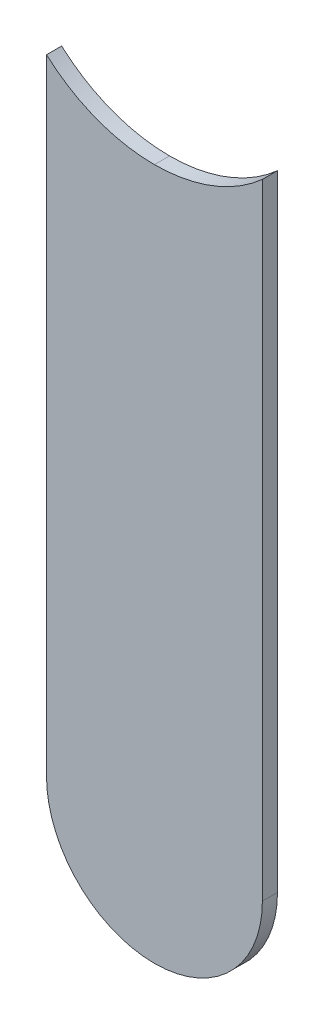
ISO-10303-21;
HEADER;
FILE_DESCRIPTION(('STEP AP214'),'2;1');
FILE_NAME('part.step','',(''),(''),'','','');
FILE_SCHEMA(('AUTOMOTIVE_DESIGN { 1 0 10303 214 1 1 1 1 }'));
ENDSEC;
DATA;
#1=APPLICATION_CONTEXT('core data for automotive mechanical design processes');
#2=APPLICATION_PROTOCOL_DEFINITION('international standard','automotive_design',2000,#1);
#3=PRODUCT_CONTEXT('',#1,'mechanical');
#4=PRODUCT('Part','Part','',(#3));
#5=PRODUCT_RELATED_PRODUCT_CATEGORY('part','',(#4));
#6=PRODUCT_DEFINITION_FORMATION('','',#4);
#7=PRODUCT_DEFINITION_CONTEXT('part definition',#1,'design');
#8=PRODUCT_DEFINITION('design','',#6,#7);
#9=PRODUCT_DEFINITION_SHAPE('','',#8);
#10=(LENGTH_UNIT() NAMED_UNIT(*) SI_UNIT(.MILLI.,.METRE.));
#11=(NAMED_UNIT(*) PLANE_ANGLE_UNIT() SI_UNIT($,.RADIAN.));
#12=(NAMED_UNIT(*) SI_UNIT($,.STERADIAN.) SOLID_ANGLE_UNIT());
#13=UNCERTAINTY_MEASURE_WITH_UNIT(LENGTH_MEASURE(1.E-05),#10,'distance_accuracy_value','');
#14=(GEOMETRIC_REPRESENTATION_CONTEXT(3) GLOBAL_UNCERTAINTY_ASSIGNED_CONTEXT((#13)) GLOBAL_UNIT_ASSIGNED_CONTEXT((#10,
#11,#12)) REPRESENTATION_CONTEXT('',''));
#15=CARTESIAN_POINT('',(0.,0.,0.));
#16=DIRECTION('',(0.,0.,1.));
#17=DIRECTION('',(1.,0.,0.));
#18=AXIS2_PLACEMENT_3D('',#15,#16,#17);
#19=CARTESIAN_POINT('',(146.554,-74.8792,-0.035));
#20=DIRECTION('',(-1.,0.,0.));
#21=DIRECTION('',(0.,0.,1.));
#22=AXIS2_PLACEMENT_3D('',#19,#20,#21);
#23=PLANE('',#22);
#24=DIRECTION('',(0.,0.,-1.));
#25=VECTOR('',#24,1.);
#26=CARTESIAN_POINT('',(146.554,-73.43150849718,-0.045));
#27=LINE('',#26,#25);
#28=CARTESIAN_POINT('',(146.554,-73.4315084972,0.));
#29=VERTEX_POINT('',#28);
#30=CARTESIAN_POINT('',(146.554,-73.4315084972,-0.035));
#31=VERTEX_POINT('',#30);
#32=EDGE_CURVE('E11',#29,#31,#27,.T.);
#33=ORIENTED_EDGE('',*,*,#32,.F.);
#34=DIRECTION('',(0.,1.,0.));
#35=VECTOR('',#34,1.);
#36=CARTESIAN_POINT('',(146.554,-74.8792,0.));
#37=LINE('',#36,#35);
#38=CARTESIAN_POINT('',(146.554,-74.8792,0.));
#39=VERTEX_POINT('',#38);
#40=EDGE_CURVE('E95',#39,#29,#37,.T.);
#41=ORIENTED_EDGE('',*,*,#40,.F.);
#42=DIRECTION('',(0.,0.,1.));
#43=VECTOR('',#42,1.);
#44=CARTESIAN_POINT('',(146.554,-74.8792,-0.035));
#45=LINE('',#44,#43);
#46=CARTESIAN_POINT('',(146.554,-74.8792,-0.035));
#47=VERTEX_POINT('',#46);
#48=EDGE_CURVE('E56',#47,#39,#45,.T.);
#49=ORIENTED_EDGE('',*,*,#48,.F.);
#50=DIRECTION('',(0.,1.,0.));
#51=VECTOR('',#50,1.);
#52=CARTESIAN_POINT('',(146.554,-74.8792,-0.035));
#53=LINE('',#52,#51);
#54=EDGE_CURVE('E126',#47,#31,#53,.T.);
#55=ORIENTED_EDGE('',*,*,#54,.T.);
#56=EDGE_LOOP('',(#33,#41,#49,#55));
#57=FACE_BOUND('',#56,.T.);
#58=ADVANCED_FACE('F17',(#57),#23,.F.);
#59=CARTESIAN_POINT('',(146.304,-73.152,-0.045));
#60=DIRECTION('',(0.,0.,-1.));
#61=DIRECTION('',(0.,-1.,0.));
#62=AXIS2_PLACEMENT_3D('',#59,#60,#61);
#63=CYLINDRICAL_SURFACE('',#62,0.375);
#64=CARTESIAN_POINT('',(146.304,-73.152,-0.035));
#65=DIRECTION('',(0.,0.,-1.));
#66=DIRECTION('',(0.,-1.,0.));
#67=AXIS2_PLACEMENT_3D('',#64,#65,#66);
#68=CIRCLE('',#67,0.375);
#69=CARTESIAN_POINT('',(146.304,-73.527,-0.035));
#70=VERTEX_POINT('',#69);
#71=EDGE_CURVE('E122',#31,#70,#68,.T.);
#72=ORIENTED_EDGE('',*,*,#71,.T.);
#73=DIRECTION('',(0.,0.,1.));
#74=VECTOR('',#73,1.);
#75=CARTESIAN_POINT('',(146.304,-73.527,-0.045));
#76=LINE('',#75,#74);
#77=CARTESIAN_POINT('',(146.304,-73.527,0.));
#78=VERTEX_POINT('',#77);
#79=EDGE_CURVE('E25',#70,#78,#76,.T.);
#80=ORIENTED_EDGE('',*,*,#79,.T.);
#81=CARTESIAN_POINT('',(146.304,-73.152,0.));
#82=DIRECTION('',(0.,0.,-1.));
#83=DIRECTION('',(0.,-1.,0.));
#84=AXIS2_PLACEMENT_3D('',#81,#82,#83);
#85=CIRCLE('',#84,0.375);
#86=EDGE_CURVE('E93',#29,#78,#85,.T.);
#87=ORIENTED_EDGE('',*,*,#86,.F.);
#88=ORIENTED_EDGE('',*,*,#32,.T.);
#89=EDGE_LOOP('',(#72,#80,#87,#88));
#90=FACE_BOUND('',#89,.T.);
#91=ADVANCED_FACE('F229',(#90),#63,.F.);
#92=CARTESIAN_POINT('',(146.304,-73.152,-0.045));
#93=DIRECTION('',(0.,0.,-1.));
#94=DIRECTION('',(0.,-1.,0.));
#95=AXIS2_PLACEMENT_3D('',#92,#93,#94);
#96=CYLINDRICAL_SURFACE('',#95,0.375);
#97=ORIENTED_EDGE('',*,*,#79,.F.);
#98=CARTESIAN_POINT('',(146.304,-73.152,-0.035));
#99=DIRECTION('',(0.,0.,-1.));
#100=DIRECTION('',(0.,-1.,0.));
#101=AXIS2_PLACEMENT_3D('',#98,#99,#100);
#102=CIRCLE('',#101,0.375);
#103=CARTESIAN_POINT('',(146.054,-73.43150849718,-0.035));
#104=VERTEX_POINT('',#103);
#105=EDGE_CURVE('E101',#70,#104,#102,.T.);
#106=ORIENTED_EDGE('',*,*,#105,.T.);
#107=DIRECTION('',(0.,0.,-1.));
#108=VECTOR('',#107,1.);
#109=CARTESIAN_POINT('',(146.054,-73.43150849718,-0.045));
#110=LINE('',#109,#108);
#111=CARTESIAN_POINT('',(146.054,-73.43150849718,0.));
#112=VERTEX_POINT('',#111);
#113=EDGE_CURVE('E99',#112,#104,#110,.T.);
#114=ORIENTED_EDGE('',*,*,#113,.F.);
#115=CARTESIAN_POINT('',(146.304,-73.152,0.));
#116=DIRECTION('',(0.,0.,-1.));
#117=DIRECTION('',(0.,-1.,0.));
#118=AXIS2_PLACEMENT_3D('',#115,#116,#117);
#119=CIRCLE('',#118,0.375);
#120=EDGE_CURVE('E85',#78,#112,#119,.T.);
#121=ORIENTED_EDGE('',*,*,#120,.F.);
#122=EDGE_LOOP('',(#97,#106,#114,#121));
#123=FACE_BOUND('',#122,.T.);
#124=ADVANCED_FACE('F100',(#123),#96,.F.);
#125=CARTESIAN_POINT('',(146.054,-73.152,0.));
#126=DIRECTION('',(0.,0.,1.));
#127=DIRECTION('',(1.,0.,0.));
#128=AXIS2_PLACEMENT_3D('',#125,#126,#127);
#129=PLANE('',#128);
#130=ORIENTED_EDGE('',*,*,#120,.T.);
#131=DIRECTION('',(0.,-1.,0.));
#132=VECTOR('',#131,1.);
#133=CARTESIAN_POINT('',(146.054,-73.152,0.));
#134=LINE('',#133,#132);
#135=CARTESIAN_POINT('',(146.054,-74.8792,0.));
#136=VERTEX_POINT('',#135);
#137=EDGE_CURVE('E90',#112,#136,#134,.T.);
#138=ORIENTED_EDGE('',*,*,#137,.T.);
#139=CARTESIAN_POINT('',(146.304,-74.8792,0.));
#140=DIRECTION('',(0.,0.,1.));
#141=DIRECTION('',(-1.,0.,0.));
#142=AXIS2_PLACEMENT_3D('',#139,#140,#141);
#143=CIRCLE('',#142,0.25);
#144=EDGE_CURVE('E96',#136,#39,#143,.T.);
#145=ORIENTED_EDGE('',*,*,#144,.T.);
#146=ORIENTED_EDGE('',*,*,#40,.T.);
#147=ORIENTED_EDGE('',*,*,#86,.T.);
#148=EDGE_LOOP('',(#130,#138,#145,#146,#147));
#149=FACE_BOUND('',#148,.T.);
#150=ADVANCED_FACE('F87',(#149),#129,.T.);
#151=CARTESIAN_POINT('',(146.304,-74.8792,-0.035));
#152=DIRECTION('',(0.,0.,-1.));
#153=DIRECTION('',(-1.,0.,0.));
#154=AXIS2_PLACEMENT_3D('',#151,#152,#153);
#155=CYLINDRICAL_SURFACE('',#154,0.25);
#156=CARTESIAN_POINT('',(146.304,-74.8792,-0.035));
#157=DIRECTION('',(0.,0.,1.));
#158=DIRECTION('',(-1.,0.,0.));
#159=AXIS2_PLACEMENT_3D('',#156,#157,#158);
#160=CIRCLE('',#159,0.25);
#161=CARTESIAN_POINT('',(146.054,-74.8792,-0.035));
#162=VERTEX_POINT('',#161);
#163=EDGE_CURVE('E129',#162,#47,#160,.T.);
#164=ORIENTED_EDGE('',*,*,#163,.T.);
#165=ORIENTED_EDGE('',*,*,#48,.T.);
#166=ORIENTED_EDGE('',*,*,#144,.F.);
#167=DIRECTION('',(0.,0.,1.));
#168=VECTOR('',#167,1.);
#169=CARTESIAN_POINT('',(146.054,-74.8792,-0.035));
#170=LINE('',#169,#168);
#171=EDGE_CURVE('E110',#162,#136,#170,.T.);
#172=ORIENTED_EDGE('',*,*,#171,.F.);
#173=EDGE_LOOP('',(#164,#165,#166,#172));
#174=FACE_BOUND('',#173,.T.);
#175=ADVANCED_FACE('F203',(#174),#155,.T.);
#176=CARTESIAN_POINT('',(146.054,-73.152,-0.035));
#177=DIRECTION('',(0.,0.,1.));
#178=DIRECTION('',(1.,0.,0.));
#179=AXIS2_PLACEMENT_3D('',#176,#177,#178);
#180=PLANE('',#179);
#181=ORIENTED_EDGE('',*,*,#71,.F.);
#182=ORIENTED_EDGE('',*,*,#54,.F.);
#183=ORIENTED_EDGE('',*,*,#163,.F.);
#184=DIRECTION('',(0.,-1.,0.));
#185=VECTOR('',#184,1.);
#186=CARTESIAN_POINT('',(146.054,-73.152,-0.035));
#187=LINE('',#186,#185);
#188=EDGE_CURVE('E106',#104,#162,#187,.T.);
#189=ORIENTED_EDGE('',*,*,#188,.F.);
#190=ORIENTED_EDGE('',*,*,#105,.F.);
#191=EDGE_LOOP('',(#181,#182,#183,#189,#190));
#192=FACE_BOUND('',#191,.T.);
#193=ADVANCED_FACE('F192',(#192),#180,.F.);
#194=CARTESIAN_POINT('',(146.054,-73.152,-0.035));
#195=DIRECTION('',(1.,0.,0.));
#196=DIRECTION('',(0.,1.,0.));
#197=AXIS2_PLACEMENT_3D('',#194,#195,#196);
#198=PLANE('',#197);
#199=ORIENTED_EDGE('',*,*,#171,.T.);
#200=ORIENTED_EDGE('',*,*,#137,.F.);
#201=ORIENTED_EDGE('',*,*,#113,.T.);
#202=ORIENTED_EDGE('',*,*,#188,.T.);
#203=EDGE_LOOP('',(#199,#200,#201,#202));
#204=FACE_BOUND('',#203,.T.);
#205=ADVANCED_FACE('F108',(#204),#198,.F.);
#206=CLOSED_SHELL('',(#58,#91,#124,#150,#175,#193,#205));
#207=MANIFOLD_SOLID_BREP('B1',#206);
#208=ADVANCED_BREP_SHAPE_REPRESENTATION('',(#18,#207),#14);
#209=SHAPE_DEFINITION_REPRESENTATION(#9,#208);
ENDSEC;
END-ISO-10303-21;
